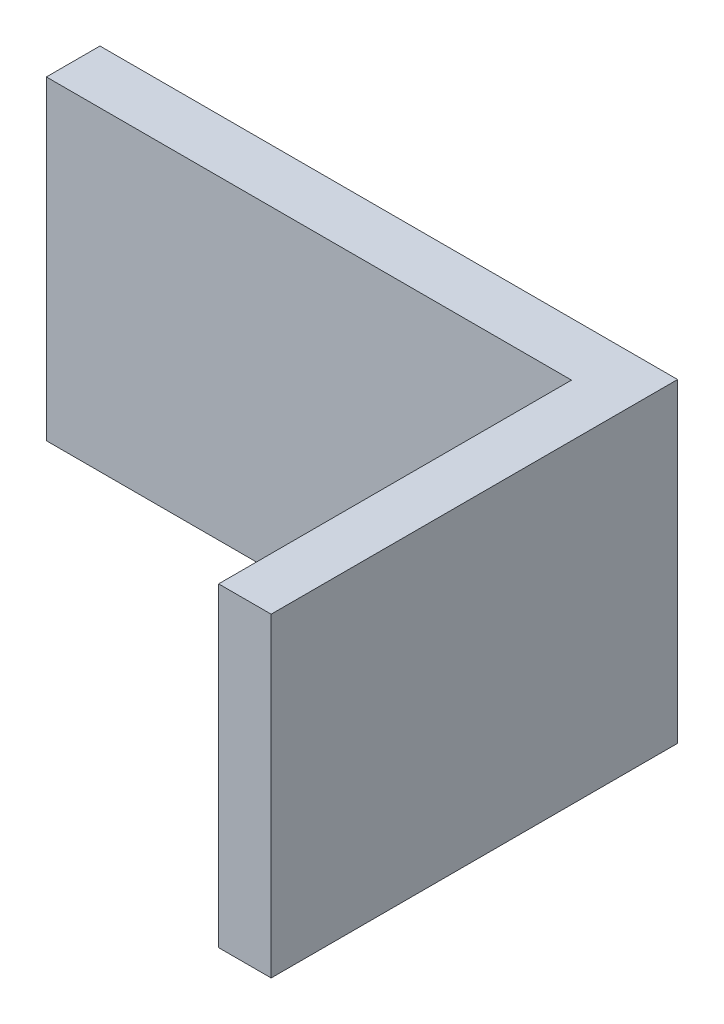
ISO-10303-21;
HEADER;
FILE_DESCRIPTION(('STEP AP214'),'2;1');
FILE_NAME('part.step','',(''),(''),'','','');
FILE_SCHEMA(('AUTOMOTIVE_DESIGN { 1 0 10303 214 1 1 1 1 }'));
ENDSEC;
DATA;
#1=APPLICATION_CONTEXT('core data for automotive mechanical design processes');
#2=APPLICATION_PROTOCOL_DEFINITION('international standard','automotive_design',2000,#1);
#3=PRODUCT_CONTEXT('',#1,'mechanical');
#4=PRODUCT('Part','Part','',(#3));
#5=PRODUCT_RELATED_PRODUCT_CATEGORY('part','',(#4));
#6=PRODUCT_DEFINITION_FORMATION('','',#4);
#7=PRODUCT_DEFINITION_CONTEXT('part definition',#1,'design');
#8=PRODUCT_DEFINITION('design','',#6,#7);
#9=PRODUCT_DEFINITION_SHAPE('','',#8);
#10=(LENGTH_UNIT() NAMED_UNIT(*) SI_UNIT(.MILLI.,.METRE.));
#11=(NAMED_UNIT(*) PLANE_ANGLE_UNIT() SI_UNIT($,.RADIAN.));
#12=(NAMED_UNIT(*) SI_UNIT($,.STERADIAN.) SOLID_ANGLE_UNIT());
#13=UNCERTAINTY_MEASURE_WITH_UNIT(LENGTH_MEASURE(1.E-05),#10,'distance_accuracy_value','');
#14=(GEOMETRIC_REPRESENTATION_CONTEXT(3) GLOBAL_UNCERTAINTY_ASSIGNED_CONTEXT((#13)) GLOBAL_UNIT_ASSIGNED_CONTEXT((#10,
#11,#12)) REPRESENTATION_CONTEXT('',''));
#15=CARTESIAN_POINT('',(0.,0.,0.));
#16=DIRECTION('',(0.,0.,1.));
#17=DIRECTION('',(1.,0.,0.));
#18=AXIS2_PLACEMENT_3D('',#15,#16,#17);
#19=CARTESIAN_POINT('',(4.55,-3.6,0.));
#20=DIRECTION('',(0.,1.,0.));
#21=DIRECTION('',(0.,0.,1.));
#22=AXIS2_PLACEMENT_3D('',#19,#20,#21);
#23=PLANE('',#22);
#24=DIRECTION('',(1.,0.,0.));
#25=VECTOR('',#24,1.);
#26=CARTESIAN_POINT('',(4.,-3.6,0.));
#27=LINE('',#26,#25);
#28=CARTESIAN_POINT('',(4.,-3.6,0.));
#29=VERTEX_POINT('',#28);
#30=CARTESIAN_POINT('',(4.55,-3.6,0.));
#31=VERTEX_POINT('',#30);
#32=EDGE_CURVE('E11',#29,#31,#27,.T.);
#33=ORIENTED_EDGE('',*,*,#32,.F.);
#34=DIRECTION('',(0.,0.,-1.));
#35=VECTOR('',#34,1.);
#36=CARTESIAN_POINT('',(4.,-3.6,0.051));
#37=LINE('',#36,#35);
#38=CARTESIAN_POINT('',(4.,-3.6,0.051));
#39=VERTEX_POINT('',#38);
#40=EDGE_CURVE('E24',#39,#29,#37,.T.);
#41=ORIENTED_EDGE('',*,*,#40,.F.);
#42=DIRECTION('',(-1.,0.,0.));
#43=VECTOR('',#42,1.);
#44=CARTESIAN_POINT('',(4.5,-3.6,0.051));
#45=LINE('',#44,#43);
#46=CARTESIAN_POINT('',(4.5,-3.6,0.051));
#47=VERTEX_POINT('',#46);
#48=EDGE_CURVE('E87',#47,#39,#45,.T.);
#49=ORIENTED_EDGE('',*,*,#48,.F.);
#50=DIRECTION('',(0.,0.,-1.));
#51=VECTOR('',#50,1.);
#52=CARTESIAN_POINT('',(4.5,-3.6,0.387));
#53=LINE('',#52,#51);
#54=CARTESIAN_POINT('',(4.5,-3.6,0.387));
#55=VERTEX_POINT('',#54);
#56=EDGE_CURVE('E114',#55,#47,#53,.T.);
#57=ORIENTED_EDGE('',*,*,#56,.F.);
#58=DIRECTION('',(-1.,0.,0.));
#59=VECTOR('',#58,1.);
#60=CARTESIAN_POINT('',(4.55,-3.6,0.387));
#61=LINE('',#60,#59);
#62=CARTESIAN_POINT('',(4.55,-3.6,0.387));
#63=VERTEX_POINT('',#62);
#64=EDGE_CURVE('E111',#63,#55,#61,.T.);
#65=ORIENTED_EDGE('',*,*,#64,.F.);
#66=DIRECTION('',(0.,0.,1.));
#67=VECTOR('',#66,1.);
#68=CARTESIAN_POINT('',(4.55,-3.6,0.));
#69=LINE('',#68,#67);
#70=EDGE_CURVE('E108',#31,#63,#69,.T.);
#71=ORIENTED_EDGE('',*,*,#70,.F.);
#72=EDGE_LOOP('',(#33,#41,#49,#57,#65,#71));
#73=FACE_BOUND('',#72,.T.);
#74=ADVANCED_FACE('F17',(#73),#23,.T.);
#75=CARTESIAN_POINT('',(4.,-3.9,0.));
#76=DIRECTION('',(0.,-1.,0.));
#77=DIRECTION('',(0.,0.,1.));
#78=AXIS2_PLACEMENT_3D('',#75,#76,#77);
#79=PLANE('',#78);
#80=DIRECTION('',(-1.,0.,0.));
#81=VECTOR('',#80,1.);
#82=CARTESIAN_POINT('',(4.55,-3.9,0.));
#83=LINE('',#82,#81);
#84=CARTESIAN_POINT('',(4.55,-3.9,0.));
#85=VERTEX_POINT('',#84);
#86=CARTESIAN_POINT('',(4.,-3.9,0.));
#87=VERTEX_POINT('',#86);
#88=EDGE_CURVE('E106',#85,#87,#83,.T.);
#89=ORIENTED_EDGE('',*,*,#88,.F.);
#90=DIRECTION('',(0.,0.,-1.));
#91=VECTOR('',#90,1.);
#92=CARTESIAN_POINT('',(4.55,-3.9,0.387));
#93=LINE('',#92,#91);
#94=CARTESIAN_POINT('',(4.55,-3.9,0.387));
#95=VERTEX_POINT('',#94);
#96=EDGE_CURVE('E103',#95,#85,#93,.T.);
#97=ORIENTED_EDGE('',*,*,#96,.F.);
#98=DIRECTION('',(1.,0.,0.));
#99=VECTOR('',#98,1.);
#100=CARTESIAN_POINT('',(4.5,-3.9,0.387));
#101=LINE('',#100,#99);
#102=CARTESIAN_POINT('',(4.5,-3.9,0.387));
#103=VERTEX_POINT('',#102);
#104=EDGE_CURVE('E100',#103,#95,#101,.T.);
#105=ORIENTED_EDGE('',*,*,#104,.F.);
#106=DIRECTION('',(0.,0.,1.));
#107=VECTOR('',#106,1.);
#108=CARTESIAN_POINT('',(4.5,-3.9,0.051));
#109=LINE('',#108,#107);
#110=CARTESIAN_POINT('',(4.5,-3.9,0.051));
#111=VERTEX_POINT('',#110);
#112=EDGE_CURVE('E72',#111,#103,#109,.T.);
#113=ORIENTED_EDGE('',*,*,#112,.F.);
#114=DIRECTION('',(1.,0.,0.));
#115=VECTOR('',#114,1.);
#116=CARTESIAN_POINT('',(4.,-3.9,0.051));
#117=LINE('',#116,#115);
#118=CARTESIAN_POINT('',(4.,-3.9,0.051));
#119=VERTEX_POINT('',#118);
#120=EDGE_CURVE('E66',#119,#111,#117,.T.);
#121=ORIENTED_EDGE('',*,*,#120,.F.);
#122=DIRECTION('',(0.,0.,1.));
#123=VECTOR('',#122,1.);
#124=CARTESIAN_POINT('',(4.,-3.9,0.));
#125=LINE('',#124,#123);
#126=EDGE_CURVE('E69',#87,#119,#125,.T.);
#127=ORIENTED_EDGE('',*,*,#126,.F.);
#128=EDGE_LOOP('',(#89,#97,#105,#113,#121,#127));
#129=FACE_BOUND('',#128,.T.);
#130=ADVANCED_FACE('F68',(#129),#79,.T.);
#131=CARTESIAN_POINT('',(4.55,-3.6,0.387));
#132=DIRECTION('',(0.,0.,1.));
#133=DIRECTION('',(0.,1.,0.));
#134=AXIS2_PLACEMENT_3D('',#131,#132,#133);
#135=PLANE('',#134);
#136=ORIENTED_EDGE('',*,*,#64,.T.);
#137=DIRECTION('',(0.,1.,0.));
#138=VECTOR('',#137,1.);
#139=CARTESIAN_POINT('',(4.5,-3.9,0.387));
#140=LINE('',#139,#138);
#141=EDGE_CURVE('E83',#103,#55,#140,.T.);
#142=ORIENTED_EDGE('',*,*,#141,.F.);
#143=ORIENTED_EDGE('',*,*,#104,.T.);
#144=DIRECTION('',(0.,-1.,0.));
#145=VECTOR('',#144,1.);
#146=CARTESIAN_POINT('',(4.55,-3.6,0.387));
#147=LINE('',#146,#145);
#148=EDGE_CURVE('E88',#63,#95,#147,.T.);
#149=ORIENTED_EDGE('',*,*,#148,.F.);
#150=EDGE_LOOP('',(#136,#142,#143,#149));
#151=FACE_BOUND('',#150,.T.);
#152=ADVANCED_FACE('F125',(#151),#135,.T.);
#153=CARTESIAN_POINT('',(4.5,-3.6,0.051));
#154=DIRECTION('',(0.,0.,1.));
#155=DIRECTION('',(0.,1.,0.));
#156=AXIS2_PLACEMENT_3D('',#153,#154,#155);
#157=PLANE('',#156);
#158=ORIENTED_EDGE('',*,*,#48,.T.);
#159=DIRECTION('',(0.,1.,0.));
#160=VECTOR('',#159,1.);
#161=CARTESIAN_POINT('',(4.,-3.9,0.051));
#162=LINE('',#161,#160);
#163=EDGE_CURVE('E81',#119,#39,#162,.T.);
#164=ORIENTED_EDGE('',*,*,#163,.F.);
#165=ORIENTED_EDGE('',*,*,#120,.T.);
#166=DIRECTION('',(0.,-1.,0.));
#167=VECTOR('',#166,1.);
#168=CARTESIAN_POINT('',(4.5,-3.6,0.051));
#169=LINE('',#168,#167);
#170=EDGE_CURVE('E89',#47,#111,#169,.T.);
#171=ORIENTED_EDGE('',*,*,#170,.F.);
#172=EDGE_LOOP('',(#158,#164,#165,#171));
#173=FACE_BOUND('',#172,.T.);
#174=ADVANCED_FACE('F86',(#173),#157,.T.);
#175=CARTESIAN_POINT('',(4.55,-3.9,0.));
#176=DIRECTION('',(1.,0.,0.));
#177=DIRECTION('',(0.,0.,1.));
#178=AXIS2_PLACEMENT_3D('',#175,#176,#177);
#179=PLANE('',#178);
#180=DIRECTION('',(0.,-1.,0.));
#181=VECTOR('',#180,1.);
#182=CARTESIAN_POINT('',(4.55,-3.6,0.));
#183=LINE('',#182,#181);
#184=EDGE_CURVE('E93',#31,#85,#183,.T.);
#185=ORIENTED_EDGE('',*,*,#184,.F.);
#186=ORIENTED_EDGE('',*,*,#70,.T.);
#187=ORIENTED_EDGE('',*,*,#148,.T.);
#188=ORIENTED_EDGE('',*,*,#96,.T.);
#189=EDGE_LOOP('',(#185,#186,#187,#188));
#190=FACE_BOUND('',#189,.T.);
#191=ADVANCED_FACE('F121',(#190),#179,.T.);
#192=CARTESIAN_POINT('',(4.,-3.6,0.));
#193=DIRECTION('',(-1.,0.,0.));
#194=DIRECTION('',(0.,0.,1.));
#195=AXIS2_PLACEMENT_3D('',#192,#193,#194);
#196=PLANE('',#195);
#197=DIRECTION('',(0.,1.,0.));
#198=VECTOR('',#197,1.);
#199=CARTESIAN_POINT('',(4.,-3.9,0.));
#200=LINE('',#199,#198);
#201=EDGE_CURVE('E82',#87,#29,#200,.T.);
#202=ORIENTED_EDGE('',*,*,#201,.F.);
#203=ORIENTED_EDGE('',*,*,#126,.T.);
#204=ORIENTED_EDGE('',*,*,#163,.T.);
#205=ORIENTED_EDGE('',*,*,#40,.T.);
#206=EDGE_LOOP('',(#202,#203,#204,#205));
#207=FACE_BOUND('',#206,.T.);
#208=ADVANCED_FACE('F80',(#207),#196,.T.);
#209=CARTESIAN_POINT('',(4.5,-3.6,0.051));
#210=DIRECTION('',(-1.,0.,0.));
#211=DIRECTION('',(0.,0.,1.));
#212=AXIS2_PLACEMENT_3D('',#209,#210,#211);
#213=PLANE('',#212);
#214=ORIENTED_EDGE('',*,*,#170,.T.);
#215=ORIENTED_EDGE('',*,*,#112,.T.);
#216=ORIENTED_EDGE('',*,*,#141,.T.);
#217=ORIENTED_EDGE('',*,*,#56,.T.);
#218=EDGE_LOOP('',(#214,#215,#216,#217));
#219=FACE_BOUND('',#218,.T.);
#220=ADVANCED_FACE('F127',(#219),#213,.T.);
#221=CARTESIAN_POINT('',(4.55,-3.9,0.));
#222=DIRECTION('',(0.,0.,-1.));
#223=DIRECTION('',(0.,1.,0.));
#224=AXIS2_PLACEMENT_3D('',#221,#222,#223);
#225=PLANE('',#224);
#226=ORIENTED_EDGE('',*,*,#88,.T.);
#227=ORIENTED_EDGE('',*,*,#201,.T.);
#228=ORIENTED_EDGE('',*,*,#32,.T.);
#229=ORIENTED_EDGE('',*,*,#184,.T.);
#230=EDGE_LOOP('',(#226,#227,#228,#229));
#231=FACE_BOUND('',#230,.T.);
#232=ADVANCED_FACE('F117',(#231),#225,.T.);
#233=CLOSED_SHELL('',(#74,#130,#152,#174,#191,#208,#220,#232));
#234=MANIFOLD_SOLID_BREP('B1',#233);
#235=ADVANCED_BREP_SHAPE_REPRESENTATION('',(#18,#234),#14);
#236=SHAPE_DEFINITION_REPRESENTATION(#9,#235);
ENDSEC;
END-ISO-10303-21;
